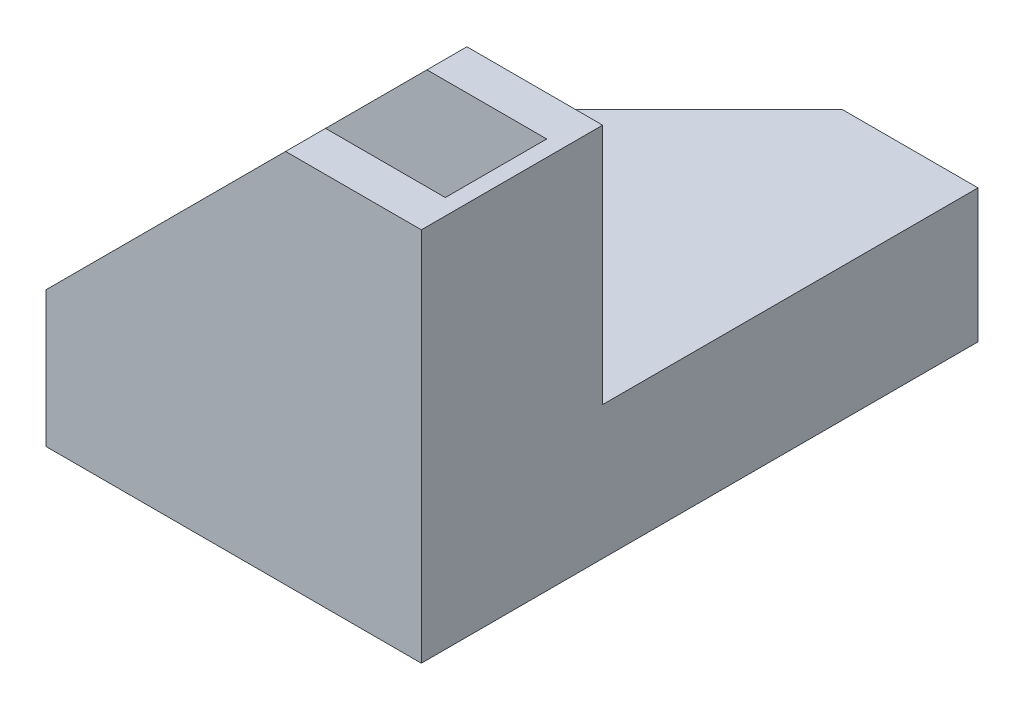
ISO-10303-21;
HEADER;
FILE_DESCRIPTION(('STEP AP214'),'2;1');
FILE_NAME('part.step','',(''),(''),'','','');
FILE_SCHEMA(('AUTOMOTIVE_DESIGN { 1 0 10303 214 1 1 1 1 }'));
ENDSEC;
DATA;
#1=APPLICATION_CONTEXT('core data for automotive mechanical design processes');
#2=APPLICATION_PROTOCOL_DEFINITION('international standard','automotive_design',2000,#1);
#3=PRODUCT_CONTEXT('',#1,'mechanical');
#4=PRODUCT('Part','Part','',(#3));
#5=PRODUCT_RELATED_PRODUCT_CATEGORY('part','',(#4));
#6=PRODUCT_DEFINITION_FORMATION('','',#4);
#7=PRODUCT_DEFINITION_CONTEXT('part definition',#1,'design');
#8=PRODUCT_DEFINITION('design','',#6,#7);
#9=PRODUCT_DEFINITION_SHAPE('','',#8);
#10=(LENGTH_UNIT() NAMED_UNIT(*) SI_UNIT(.MILLI.,.METRE.));
#11=(NAMED_UNIT(*) PLANE_ANGLE_UNIT() SI_UNIT($,.RADIAN.));
#12=(NAMED_UNIT(*) SI_UNIT($,.STERADIAN.) SOLID_ANGLE_UNIT());
#13=UNCERTAINTY_MEASURE_WITH_UNIT(LENGTH_MEASURE(1.E-05),#10,'distance_accuracy_value','');
#14=(GEOMETRIC_REPRESENTATION_CONTEXT(3) GLOBAL_UNCERTAINTY_ASSIGNED_CONTEXT((#13)) GLOBAL_UNIT_ASSIGNED_CONTEXT((#10,
#11,#12)) REPRESENTATION_CONTEXT('',''));
#15=CARTESIAN_POINT('',(0.,0.,0.));
#16=DIRECTION('',(0.,0.,1.));
#17=DIRECTION('',(1.,0.,0.));
#18=AXIS2_PLACEMENT_3D('',#15,#16,#17);
#19=CARTESIAN_POINT('',(0.,0.,-11.35));
#20=DIRECTION('',(0.,0.,-1.));
#21=DIRECTION('',(-1.,0.,0.));
#22=AXIS2_PLACEMENT_3D('',#19,#20,#21);
#23=PLANE('',#22);
#24=DIRECTION('',(1.,0.,0.));
#25=VECTOR('',#24,1.);
#26=CARTESIAN_POINT('',(-47.,16.7,-11.35));
#27=LINE('',#26,#25);
#28=CARTESIAN_POINT('',(-47.,16.7,-11.35));
#29=VERTEX_POINT('',#28);
#30=CARTESIAN_POINT('',(0.,16.7,-11.35));
#31=VERTEX_POINT('',#30);
#32=EDGE_CURVE('E287',#29,#31,#27,.T.);
#33=ORIENTED_EDGE('',*,*,#32,.F.);
#34=DIRECTION('',(0.,-1.,0.));
#35=VECTOR('',#34,1.);
#36=CARTESIAN_POINT('',(-47.,0.,-11.35));
#37=LINE('',#36,#35);
#38=CARTESIAN_POINT('',(-47.,17.,-11.35));
#39=VERTEX_POINT('',#38);
#40=EDGE_CURVE('E176',#39,#29,#37,.T.);
#41=ORIENTED_EDGE('',*,*,#40,.F.);
#42=DIRECTION('',(-0.707106781186547,-0.707106781186547,0.));
#43=VECTOR('',#42,1.);
#44=CARTESIAN_POINT('',(-17.,47.,-11.35));
#45=LINE('',#44,#43);
#46=CARTESIAN_POINT('',(-17.,47.,-11.35));
#47=VERTEX_POINT('',#46);
#48=EDGE_CURVE('E246',#47,#39,#45,.T.);
#49=ORIENTED_EDGE('',*,*,#48,.F.);
#50=DIRECTION('',(-1.,0.,0.));
#51=VECTOR('',#50,1.);
#52=CARTESIAN_POINT('',(0.,47.,-11.35));
#53=LINE('',#52,#51);
#54=CARTESIAN_POINT('',(0.,47.,-11.35));
#55=VERTEX_POINT('',#54);
#56=EDGE_CURVE('E243',#55,#47,#53,.T.);
#57=ORIENTED_EDGE('',*,*,#56,.F.);
#58=DIRECTION('',(0.,1.,0.));
#59=VECTOR('',#58,1.);
#60=CARTESIAN_POINT('',(0.,0.,-11.35));
#61=LINE('',#60,#59);
#62=EDGE_CURVE('E225',#31,#55,#61,.T.);
#63=ORIENTED_EDGE('',*,*,#62,.F.);
#64=EDGE_LOOP('',(#33,#41,#49,#57,#63));
#65=FACE_BOUND('',#64,.T.);
#66=ADVANCED_FACE('F33',(#65),#23,.T.);
#67=CARTESIAN_POINT('',(-17.,47.,11.35));
#68=DIRECTION('',(0.707106781186548,-0.707106781186548,0.));
#69=DIRECTION('',(0.707106781186548,0.707106781186548,0.));
#70=AXIS2_PLACEMENT_3D('',#67,#68,#69);
#71=PLANE('',#70);
#72=DIRECTION('',(-0.707106781186547,-0.707106781186547,0.));
#73=VECTOR('',#72,1.);
#74=CARTESIAN_POINT('',(-47.,17.,6.35));
#75=LINE('',#74,#73);
#76=CARTESIAN_POINT('',(-17.,47.,6.35));
#77=VERTEX_POINT('',#76);
#78=CARTESIAN_POINT('',(-47.,17.,6.35));
#79=VERTEX_POINT('',#78);
#80=EDGE_CURVE('E194',#77,#79,#75,.T.);
#81=ORIENTED_EDGE('',*,*,#80,.T.);
#82=DIRECTION('',(0.,0.,-1.));
#83=VECTOR('',#82,1.);
#84=CARTESIAN_POINT('',(-47.,17.,11.35));
#85=LINE('',#84,#83);
#86=CARTESIAN_POINT('',(-47.,17.,11.35));
#87=VERTEX_POINT('',#86);
#88=EDGE_CURVE('E254',#87,#79,#85,.T.);
#89=ORIENTED_EDGE('',*,*,#88,.F.);
#90=DIRECTION('',(-0.707106781186547,-0.707106781186547,0.));
#91=VECTOR('',#90,1.);
#92=CARTESIAN_POINT('',(-17.,47.,11.35));
#93=LINE('',#92,#91);
#94=CARTESIAN_POINT('',(-17.,47.,11.35));
#95=VERTEX_POINT('',#94);
#96=EDGE_CURVE('E237',#95,#87,#93,.T.);
#97=ORIENTED_EDGE('',*,*,#96,.F.);
#98=DIRECTION('',(0.,0.,-1.));
#99=VECTOR('',#98,1.);
#100=CARTESIAN_POINT('',(-17.,47.,11.35));
#101=LINE('',#100,#99);
#102=EDGE_CURVE('E258',#95,#77,#101,.T.);
#103=ORIENTED_EDGE('',*,*,#102,.T.);
#104=EDGE_LOOP('',(#81,#89,#97,#103));
#105=FACE_BOUND('',#104,.T.);
#106=ADVANCED_FACE('F334',(#105),#71,.F.);
#107=CARTESIAN_POINT('',(0.,0.,11.35));
#108=DIRECTION('',(0.,1.,0.));
#109=DIRECTION('',(-1.,0.,0.));
#110=AXIS2_PLACEMENT_3D('',#107,#108,#109);
#111=PLANE('',#110);
#112=DIRECTION('',(0.,0.,-1.));
#113=VECTOR('',#112,1.);
#114=CARTESIAN_POINT('',(-47.,0.,11.35));
#115=LINE('',#114,#113);
#116=CARTESIAN_POINT('',(-47.,0.,11.35));
#117=VERTEX_POINT('',#116);
#118=CARTESIAN_POINT('',(-47.,0.,-28.35));
#119=VERTEX_POINT('',#118);
#120=EDGE_CURVE('E241',#117,#119,#115,.T.);
#121=ORIENTED_EDGE('',*,*,#120,.T.);
#122=DIRECTION('',(0.707106781186548,0.,-0.707106781186548));
#123=VECTOR('',#122,1.);
#124=CARTESIAN_POINT('',(-43.35,0.,-32.));
#125=LINE('',#124,#123);
#126=CARTESIAN_POINT('',(-17.,0.,-58.35));
#127=VERTEX_POINT('',#126);
#128=EDGE_CURVE('E278',#119,#127,#125,.T.);
#129=ORIENTED_EDGE('',*,*,#128,.T.);
#130=DIRECTION('',(-1.,0.,0.));
#131=VECTOR('',#130,1.);
#132=CARTESIAN_POINT('',(-47.,0.,-58.35));
#133=LINE('',#132,#131);
#134=CARTESIAN_POINT('',(0.,0.,-58.35));
#135=VERTEX_POINT('',#134);
#136=EDGE_CURVE('E284',#135,#127,#133,.T.);
#137=ORIENTED_EDGE('',*,*,#136,.F.);
#138=DIRECTION('',(0.,0.,-1.));
#139=VECTOR('',#138,1.);
#140=CARTESIAN_POINT('',(0.,0.,11.35));
#141=LINE('',#140,#139);
#142=CARTESIAN_POINT('',(0.,0.,11.35));
#143=VERTEX_POINT('',#142);
#144=EDGE_CURVE('E263',#143,#135,#141,.T.);
#145=ORIENTED_EDGE('',*,*,#144,.F.);
#146=DIRECTION('',(1.,0.,0.));
#147=VECTOR('',#146,1.);
#148=CARTESIAN_POINT('',(0.,0.,11.35));
#149=LINE('',#148,#147);
#150=EDGE_CURVE('E230',#117,#143,#149,.T.);
#151=ORIENTED_EDGE('',*,*,#150,.F.);
#152=EDGE_LOOP('',(#121,#129,#137,#145,#151));
#153=FACE_BOUND('',#152,.T.);
#154=ADVANCED_FACE('F35',(#153),#111,.F.);
#155=CARTESIAN_POINT('',(0.,0.,11.35));
#156=DIRECTION('',(-1.,0.,0.));
#157=DIRECTION('',(0.,0.,1.));
#158=AXIS2_PLACEMENT_3D('',#155,#156,#157);
#159=PLANE('',#158);
#160=ORIENTED_EDGE('',*,*,#144,.T.);
#161=DIRECTION('',(0.,-1.,0.));
#162=VECTOR('',#161,1.);
#163=CARTESIAN_POINT('',(0.,14.7,-58.35));
#164=LINE('',#163,#162);
#165=CARTESIAN_POINT('',(0.,16.7,-58.35));
#166=VERTEX_POINT('',#165);
#167=EDGE_CURVE('E183',#166,#135,#164,.T.);
#168=ORIENTED_EDGE('',*,*,#167,.F.);
#169=DIRECTION('',(0.,0.,1.));
#170=VECTOR('',#169,1.);
#171=CARTESIAN_POINT('',(0.,16.7,-58.35));
#172=LINE('',#171,#170);
#173=EDGE_CURVE('E178',#166,#31,#172,.T.);
#174=ORIENTED_EDGE('',*,*,#173,.T.);
#175=ORIENTED_EDGE('',*,*,#62,.T.);
#176=DIRECTION('',(0.,0.,-1.));
#177=VECTOR('',#176,1.);
#178=CARTESIAN_POINT('',(0.,47.,11.35));
#179=LINE('',#178,#177);
#180=CARTESIAN_POINT('',(0.,47.,11.35));
#181=VERTEX_POINT('',#180);
#182=EDGE_CURVE('E261',#181,#55,#179,.T.);
#183=ORIENTED_EDGE('',*,*,#182,.F.);
#184=DIRECTION('',(0.,1.,0.));
#185=VECTOR('',#184,1.);
#186=CARTESIAN_POINT('',(0.,0.,11.35));
#187=LINE('',#186,#185);
#188=EDGE_CURVE('E233',#143,#181,#187,.T.);
#189=ORIENTED_EDGE('',*,*,#188,.F.);
#190=EDGE_LOOP('',(#160,#168,#174,#175,#183,#189));
#191=FACE_BOUND('',#190,.T.);
#192=ADVANCED_FACE('F301',(#191),#159,.F.);
#193=CARTESIAN_POINT('',(0.,47.,11.35));
#194=DIRECTION('',(0.,-1.,0.));
#195=DIRECTION('',(0.,0.,-1.));
#196=AXIS2_PLACEMENT_3D('',#193,#194,#195);
#197=PLANE('',#196);
#198=CARTESIAN_POINT('',(-17.,47.,-6.35));
#199=VERTEX_POINT('',#198);
#200=EDGE_CURVE('E257',#199,#47,#101,.T.);
#201=ORIENTED_EDGE('',*,*,#200,.F.);
#202=DIRECTION('',(-1.,0.,0.));
#203=VECTOR('',#202,1.);
#204=CARTESIAN_POINT('',(-17.,47.,-6.35));
#205=LINE('',#204,#203);
#206=CARTESIAN_POINT('',(-2.,47.,-6.35));
#207=VERTEX_POINT('',#206);
#208=EDGE_CURVE('E207',#207,#199,#205,.T.);
#209=ORIENTED_EDGE('',*,*,#208,.F.);
#210=DIRECTION('',(0.,0.,1.));
#211=VECTOR('',#210,1.);
#212=CARTESIAN_POINT('',(-2.,47.,-6.35));
#213=LINE('',#212,#211);
#214=CARTESIAN_POINT('',(-2.,47.,6.35));
#215=VERTEX_POINT('',#214);
#216=EDGE_CURVE('E222',#207,#215,#213,.T.);
#217=ORIENTED_EDGE('',*,*,#216,.T.);
#218=DIRECTION('',(-1.,0.,0.));
#219=VECTOR('',#218,1.);
#220=CARTESIAN_POINT('',(-17.,47.,6.35));
#221=LINE('',#220,#219);
#222=EDGE_CURVE('E198',#215,#77,#221,.T.);
#223=ORIENTED_EDGE('',*,*,#222,.T.);
#224=ORIENTED_EDGE('',*,*,#102,.F.);
#225=DIRECTION('',(-1.,0.,0.));
#226=VECTOR('',#225,1.);
#227=CARTESIAN_POINT('',(0.,47.,11.35));
#228=LINE('',#227,#226);
#229=EDGE_CURVE('E235',#181,#95,#228,.T.);
#230=ORIENTED_EDGE('',*,*,#229,.F.);
#231=ORIENTED_EDGE('',*,*,#182,.T.);
#232=ORIENTED_EDGE('',*,*,#56,.T.);
#233=EDGE_LOOP('',(#201,#209,#217,#223,#224,#230,#231,#232));
#234=FACE_BOUND('',#233,.T.);
#235=ADVANCED_FACE('F383',(#234),#197,.F.);
#236=CARTESIAN_POINT('',(-47.,17.,-6.35));
#237=VERTEX_POINT('',#236);
#238=EDGE_CURVE('E253',#237,#39,#85,.T.);
#239=ORIENTED_EDGE('',*,*,#238,.F.);
#240=DIRECTION('',(-0.707106781186547,-0.707106781186547,0.));
#241=VECTOR('',#240,1.);
#242=CARTESIAN_POINT('',(-47.,17.,-6.35));
#243=LINE('',#242,#241);
#244=EDGE_CURVE('E195',#199,#237,#243,.T.);
#245=ORIENTED_EDGE('',*,*,#244,.F.);
#246=ORIENTED_EDGE('',*,*,#200,.T.);
#247=ORIENTED_EDGE('',*,*,#48,.T.);
#248=EDGE_LOOP('',(#239,#245,#246,#247));
#249=FACE_BOUND('',#248,.T.);
#250=ADVANCED_FACE('F343',(#249),#71,.F.);
#251=CARTESIAN_POINT('',(-47.,0.,11.35));
#252=DIRECTION('',(1.,0.,0.));
#253=DIRECTION('',(0.,0.,-1.));
#254=AXIS2_PLACEMENT_3D('',#251,#252,#253);
#255=PLANE('',#254);
#256=DIRECTION('',(0.,0.,1.));
#257=VECTOR('',#256,1.);
#258=CARTESIAN_POINT('',(-47.,16.7,-58.35));
#259=LINE('',#258,#257);
#260=CARTESIAN_POINT('',(-47.,16.7,-28.35));
#261=VERTEX_POINT('',#260);
#262=EDGE_CURVE('E168',#261,#29,#259,.T.);
#263=ORIENTED_EDGE('',*,*,#262,.F.);
#264=DIRECTION('',(0.,1.,0.));
#265=VECTOR('',#264,1.);
#266=CARTESIAN_POINT('',(-47.,-30.3,-28.35));
#267=LINE('',#266,#265);
#268=CARTESIAN_POINT('',(-47.,14.7,-28.35));
#269=VERTEX_POINT('',#268);
#270=EDGE_CURVE('E155',#269,#261,#267,.T.);
#271=ORIENTED_EDGE('',*,*,#270,.F.);
#272=DIRECTION('',(0.,0.,1.));
#273=VECTOR('',#272,1.);
#274=CARTESIAN_POINT('',(-47.,14.7,-58.35));
#275=LINE('',#274,#273);
#276=CARTESIAN_POINT('',(-47.,14.7,-11.35));
#277=VERTEX_POINT('',#276);
#278=EDGE_CURVE('E177',#269,#277,#275,.T.);
#279=ORIENTED_EDGE('',*,*,#278,.T.);
#280=CARTESIAN_POINT('',(-47.,2.,-11.35));
#281=VERTEX_POINT('',#280);
#282=EDGE_CURVE('E249',#277,#281,#37,.T.);
#283=ORIENTED_EDGE('',*,*,#282,.T.);
#284=DIRECTION('',(0.,0.,1.));
#285=VECTOR('',#284,1.);
#286=CARTESIAN_POINT('',(-47.,2.,-58.35));
#287=LINE('',#286,#285);
#288=CARTESIAN_POINT('',(-47.,2.,-28.35));
#289=VERTEX_POINT('',#288);
#290=EDGE_CURVE('E192',#289,#281,#287,.T.);
#291=ORIENTED_EDGE('',*,*,#290,.F.);
#292=EDGE_CURVE('E162',#119,#289,#267,.T.);
#293=ORIENTED_EDGE('',*,*,#292,.F.);
#294=ORIENTED_EDGE('',*,*,#120,.F.);
#295=DIRECTION('',(0.,-1.,0.));
#296=VECTOR('',#295,1.);
#297=CARTESIAN_POINT('',(-47.,0.,11.35));
#298=LINE('',#297,#296);
#299=EDGE_CURVE('E239',#87,#117,#298,.T.);
#300=ORIENTED_EDGE('',*,*,#299,.F.);
#301=ORIENTED_EDGE('',*,*,#88,.T.);
#302=DIRECTION('',(0.,-1.,0.));
#303=VECTOR('',#302,1.);
#304=CARTESIAN_POINT('',(-47.,17.,6.35));
#305=LINE('',#304,#303);
#306=CARTESIAN_POINT('',(-47.,1.99999999999999,6.35));
#307=VERTEX_POINT('',#306);
#308=EDGE_CURVE('E212',#79,#307,#305,.T.);
#309=ORIENTED_EDGE('',*,*,#308,.T.);
#310=DIRECTION('',(0.,0.,1.));
#311=VECTOR('',#310,1.);
#312=CARTESIAN_POINT('',(-47.,1.99999999999999,-6.35));
#313=LINE('',#312,#311);
#314=CARTESIAN_POINT('',(-47.,1.99999999999999,-6.35));
#315=VERTEX_POINT('',#314);
#316=EDGE_CURVE('E209',#315,#307,#313,.T.);
#317=ORIENTED_EDGE('',*,*,#316,.F.);
#318=DIRECTION('',(0.,-1.,0.));
#319=VECTOR('',#318,1.);
#320=CARTESIAN_POINT('',(-47.,17.,-6.35));
#321=LINE('',#320,#319);
#322=EDGE_CURVE('E197',#237,#315,#321,.T.);
#323=ORIENTED_EDGE('',*,*,#322,.F.);
#324=ORIENTED_EDGE('',*,*,#238,.T.);
#325=ORIENTED_EDGE('',*,*,#40,.T.);
#326=EDGE_LOOP('',(#263,#271,#279,#283,#291,#293,#294,#300,#301,#309,#317,#323,#324,#325));
#327=FACE_BOUND('',#326,.T.);
#328=ADVANCED_FACE('F174',(#327),#255,.F.);
#329=CARTESIAN_POINT('',(0.,0.,11.35));
#330=DIRECTION('',(0.,0.,-1.));
#331=DIRECTION('',(-1.,0.,0.));
#332=AXIS2_PLACEMENT_3D('',#329,#330,#331);
#333=PLANE('',#332);
#334=ORIENTED_EDGE('',*,*,#150,.T.);
#335=ORIENTED_EDGE('',*,*,#188,.T.);
#336=ORIENTED_EDGE('',*,*,#229,.T.);
#337=ORIENTED_EDGE('',*,*,#96,.T.);
#338=ORIENTED_EDGE('',*,*,#299,.T.);
#339=EDGE_LOOP('',(#334,#335,#336,#337,#338));
#340=FACE_BOUND('',#339,.T.);
#341=ADVANCED_FACE('F348',(#340),#333,.F.);
#342=DIRECTION('',(-1.,0.,0.));
#343=VECTOR('',#342,1.);
#344=CARTESIAN_POINT('',(-47.,14.7,-11.35));
#345=LINE('',#344,#343);
#346=CARTESIAN_POINT('',(-2.,14.7,-11.35));
#347=VERTEX_POINT('',#346);
#348=EDGE_CURVE('E299',#347,#277,#345,.T.);
#349=ORIENTED_EDGE('',*,*,#348,.F.);
#350=DIRECTION('',(0.,1.,0.));
#351=VECTOR('',#350,1.);
#352=CARTESIAN_POINT('',(-2.,14.7,-11.35));
#353=LINE('',#352,#351);
#354=CARTESIAN_POINT('',(-2.,2.,-11.35));
#355=VERTEX_POINT('',#354);
#356=EDGE_CURVE('E296',#355,#347,#353,.T.);
#357=ORIENTED_EDGE('',*,*,#356,.F.);
#358=DIRECTION('',(1.,0.,0.));
#359=VECTOR('',#358,1.);
#360=CARTESIAN_POINT('',(-2.,2.,-11.35));
#361=LINE('',#360,#359);
#362=EDGE_CURVE('E283',#281,#355,#361,.T.);
#363=ORIENTED_EDGE('',*,*,#362,.F.);
#364=ORIENTED_EDGE('',*,*,#282,.F.);
#365=EDGE_LOOP('',(#349,#357,#363,#364));
#366=FACE_BOUND('',#365,.T.);
#367=ADVANCED_FACE('F319',(#366),#23,.T.);
#368=CARTESIAN_POINT('',(-2.,47.,-6.35));
#369=DIRECTION('',(1.,0.,0.));
#370=DIRECTION('',(0.,0.,-1.));
#371=AXIS2_PLACEMENT_3D('',#368,#369,#370);
#372=PLANE('',#371);
#373=DIRECTION('',(0.,1.,0.));
#374=VECTOR('',#373,1.);
#375=CARTESIAN_POINT('',(-2.,47.,6.35));
#376=LINE('',#375,#374);
#377=CARTESIAN_POINT('',(-2.,1.99999999999999,6.35));
#378=VERTEX_POINT('',#377);
#379=EDGE_CURVE('E218',#378,#215,#376,.T.);
#380=ORIENTED_EDGE('',*,*,#379,.T.);
#381=ORIENTED_EDGE('',*,*,#216,.F.);
#382=DIRECTION('',(0.,1.,0.));
#383=VECTOR('',#382,1.);
#384=CARTESIAN_POINT('',(-2.,47.,-6.35));
#385=LINE('',#384,#383);
#386=CARTESIAN_POINT('',(-2.,1.99999999999999,-6.35));
#387=VERTEX_POINT('',#386);
#388=EDGE_CURVE('E204',#387,#207,#385,.T.);
#389=ORIENTED_EDGE('',*,*,#388,.F.);
#390=DIRECTION('',(0.,0.,1.));
#391=VECTOR('',#390,1.);
#392=CARTESIAN_POINT('',(-2.,1.99999999999999,-6.35));
#393=LINE('',#392,#391);
#394=EDGE_CURVE('E226',#387,#378,#393,.T.);
#395=ORIENTED_EDGE('',*,*,#394,.T.);
#396=EDGE_LOOP('',(#380,#381,#389,#395));
#397=FACE_BOUND('',#396,.T.);
#398=ADVANCED_FACE('F347',(#397),#372,.F.);
#399=CARTESIAN_POINT('',(-2.,1.99999999999999,-6.35));
#400=DIRECTION('',(0.,-1.,0.));
#401=DIRECTION('',(0.,0.,-1.));
#402=AXIS2_PLACEMENT_3D('',#399,#400,#401);
#403=PLANE('',#402);
#404=DIRECTION('',(1.,0.,0.));
#405=VECTOR('',#404,1.);
#406=CARTESIAN_POINT('',(-2.,1.99999999999999,6.35));
#407=LINE('',#406,#405);
#408=EDGE_CURVE('E215',#307,#378,#407,.T.);
#409=ORIENTED_EDGE('',*,*,#408,.T.);
#410=ORIENTED_EDGE('',*,*,#394,.F.);
#411=DIRECTION('',(1.,0.,0.));
#412=VECTOR('',#411,1.);
#413=CARTESIAN_POINT('',(-2.,1.99999999999999,-6.35));
#414=LINE('',#413,#412);
#415=EDGE_CURVE('E201',#315,#387,#414,.T.);
#416=ORIENTED_EDGE('',*,*,#415,.F.);
#417=ORIENTED_EDGE('',*,*,#316,.T.);
#418=EDGE_LOOP('',(#409,#410,#416,#417));
#419=FACE_BOUND('',#418,.T.);
#420=ADVANCED_FACE('F352',(#419),#403,.F.);
#421=CARTESIAN_POINT('',(0.,0.,-6.35));
#422=DIRECTION('',(0.,0.,-1.));
#423=DIRECTION('',(-1.,0.,0.));
#424=AXIS2_PLACEMENT_3D('',#421,#422,#423);
#425=PLANE('',#424);
#426=ORIENTED_EDGE('',*,*,#244,.T.);
#427=ORIENTED_EDGE('',*,*,#322,.T.);
#428=ORIENTED_EDGE('',*,*,#415,.T.);
#429=ORIENTED_EDGE('',*,*,#388,.T.);
#430=ORIENTED_EDGE('',*,*,#208,.T.);
#431=EDGE_LOOP('',(#426,#427,#428,#429,#430));
#432=FACE_BOUND('',#431,.T.);
#433=ADVANCED_FACE('F363',(#432),#425,.F.);
#434=CARTESIAN_POINT('',(0.,0.,6.35));
#435=DIRECTION('',(0.,0.,-1.));
#436=DIRECTION('',(-1.,0.,0.));
#437=AXIS2_PLACEMENT_3D('',#434,#435,#436);
#438=PLANE('',#437);
#439=ORIENTED_EDGE('',*,*,#80,.F.);
#440=ORIENTED_EDGE('',*,*,#222,.F.);
#441=ORIENTED_EDGE('',*,*,#379,.F.);
#442=ORIENTED_EDGE('',*,*,#408,.F.);
#443=ORIENTED_EDGE('',*,*,#308,.F.);
#444=EDGE_LOOP('',(#439,#440,#441,#442,#443));
#445=FACE_BOUND('',#444,.T.);
#446=ADVANCED_FACE('F331',(#445),#438,.T.);
#447=CARTESIAN_POINT('',(-2.,2.,-58.35));
#448=DIRECTION('',(0.,-1.,0.));
#449=DIRECTION('',(0.,0.,-1.));
#450=AXIS2_PLACEMENT_3D('',#447,#448,#449);
#451=PLANE('',#450);
#452=DIRECTION('',(1.,0.,0.));
#453=VECTOR('',#452,1.);
#454=CARTESIAN_POINT('',(-2.,2.,-58.35));
#455=LINE('',#454,#453);
#456=CARTESIAN_POINT('',(-17.,2.,-58.35));
#457=VERTEX_POINT('',#456);
#458=CARTESIAN_POINT('',(-2.,2.,-58.35));
#459=VERTEX_POINT('',#458);
#460=EDGE_CURVE('E286',#457,#459,#455,.T.);
#461=ORIENTED_EDGE('',*,*,#460,.F.);
#462=DIRECTION('',(-0.707106781186548,0.,0.707106781186548));
#463=VECTOR('',#462,1.);
#464=CARTESIAN_POINT('',(-9.5,2.,-65.85));
#465=LINE('',#464,#463);
#466=EDGE_CURVE('E56',#457,#289,#465,.T.);
#467=ORIENTED_EDGE('',*,*,#466,.T.);
#468=ORIENTED_EDGE('',*,*,#290,.T.);
#469=ORIENTED_EDGE('',*,*,#362,.T.);
#470=DIRECTION('',(0.,0.,1.));
#471=VECTOR('',#470,1.);
#472=CARTESIAN_POINT('',(-2.,2.,-58.35));
#473=LINE('',#472,#471);
#474=EDGE_CURVE('E189',#459,#355,#473,.T.);
#475=ORIENTED_EDGE('',*,*,#474,.F.);
#476=EDGE_LOOP('',(#461,#467,#468,#469,#475));
#477=FACE_BOUND('',#476,.T.);
#478=ADVANCED_FACE('F316',(#477),#451,.F.);
#479=CARTESIAN_POINT('',(-2.,14.7,-58.35));
#480=DIRECTION('',(1.,0.,0.));
#481=DIRECTION('',(0.,0.,-1.));
#482=AXIS2_PLACEMENT_3D('',#479,#480,#481);
#483=PLANE('',#482);
#484=ORIENTED_EDGE('',*,*,#356,.T.);
#485=DIRECTION('',(0.,0.,1.));
#486=VECTOR('',#485,1.);
#487=CARTESIAN_POINT('',(-2.,14.7,-58.35));
#488=LINE('',#487,#486);
#489=CARTESIAN_POINT('',(-2.,14.7,-58.35));
#490=VERTEX_POINT('',#489);
#491=EDGE_CURVE('E180',#490,#347,#488,.T.);
#492=ORIENTED_EDGE('',*,*,#491,.F.);
#493=DIRECTION('',(0.,1.,0.));
#494=VECTOR('',#493,1.);
#495=CARTESIAN_POINT('',(-2.,14.7,-58.35));
#496=LINE('',#495,#494);
#497=EDGE_CURVE('E289',#459,#490,#496,.T.);
#498=ORIENTED_EDGE('',*,*,#497,.F.);
#499=ORIENTED_EDGE('',*,*,#474,.T.);
#500=EDGE_LOOP('',(#484,#492,#498,#499));
#501=FACE_BOUND('',#500,.T.);
#502=ADVANCED_FACE('F322',(#501),#483,.F.);
#503=CARTESIAN_POINT('',(-47.,14.7,-58.35));
#504=DIRECTION('',(0.,1.,0.));
#505=DIRECTION('',(0.,0.,1.));
#506=AXIS2_PLACEMENT_3D('',#503,#504,#505);
#507=PLANE('',#506);
#508=ORIENTED_EDGE('',*,*,#278,.F.);
#509=DIRECTION('',(0.707106781186548,0.,-0.707106781186548));
#510=VECTOR('',#509,1.);
#511=CARTESIAN_POINT('',(-32.,14.7,-43.35));
#512=LINE('',#511,#510);
#513=CARTESIAN_POINT('',(-17.,14.7,-58.35));
#514=VERTEX_POINT('',#513);
#515=EDGE_CURVE('E158',#269,#514,#512,.T.);
#516=ORIENTED_EDGE('',*,*,#515,.T.);
#517=DIRECTION('',(-1.,0.,0.));
#518=VECTOR('',#517,1.);
#519=CARTESIAN_POINT('',(-47.,14.7,-58.35));
#520=LINE('',#519,#518);
#521=EDGE_CURVE('E273',#490,#514,#520,.T.);
#522=ORIENTED_EDGE('',*,*,#521,.F.);
#523=ORIENTED_EDGE('',*,*,#491,.T.);
#524=ORIENTED_EDGE('',*,*,#348,.T.);
#525=EDGE_LOOP('',(#508,#516,#522,#523,#524));
#526=FACE_BOUND('',#525,.T.);
#527=ADVANCED_FACE('F275',(#526),#507,.F.);
#528=CARTESIAN_POINT('',(-47.,16.7,-58.35));
#529=DIRECTION('',(0.,-1.,0.));
#530=DIRECTION('',(0.,0.,-1.));
#531=AXIS2_PLACEMENT_3D('',#528,#529,#530);
#532=PLANE('',#531);
#533=DIRECTION('',(1.,0.,0.));
#534=VECTOR('',#533,1.);
#535=CARTESIAN_POINT('',(-47.,16.7,-58.35));
#536=LINE('',#535,#534);
#537=CARTESIAN_POINT('',(-17.,16.7,-58.35));
#538=VERTEX_POINT('',#537);
#539=EDGE_CURVE('E171',#538,#166,#536,.T.);
#540=ORIENTED_EDGE('',*,*,#539,.F.);
#541=DIRECTION('',(0.707106781186547,0.,-0.707106781186547));
#542=VECTOR('',#541,1.);
#543=CARTESIAN_POINT('',(-17.,16.7,-58.35));
#544=LINE('',#543,#542);
#545=EDGE_CURVE('E48',#261,#538,#544,.T.);
#546=ORIENTED_EDGE('',*,*,#545,.F.);
#547=ORIENTED_EDGE('',*,*,#262,.T.);
#548=ORIENTED_EDGE('',*,*,#32,.T.);
#549=ORIENTED_EDGE('',*,*,#173,.F.);
#550=EDGE_LOOP('',(#540,#546,#547,#548,#549));
#551=FACE_BOUND('',#550,.T.);
#552=ADVANCED_FACE('F166',(#551),#532,.F.);
#553=CARTESIAN_POINT('',(0.,0.,-58.35));
#554=DIRECTION('',(0.,0.,1.));
#555=DIRECTION('',(1.,0.,0.));
#556=AXIS2_PLACEMENT_3D('',#553,#554,#555);
#557=PLANE('',#556);
#558=ORIENTED_EDGE('',*,*,#136,.T.);
#559=DIRECTION('',(0.,1.,0.));
#560=VECTOR('',#559,1.);
#561=CARTESIAN_POINT('',(-17.,0.,-58.35));
#562=LINE('',#561,#560);
#563=EDGE_CURVE('E11',#127,#457,#562,.T.);
#564=ORIENTED_EDGE('',*,*,#563,.T.);
#565=ORIENTED_EDGE('',*,*,#460,.T.);
#566=ORIENTED_EDGE('',*,*,#497,.T.);
#567=ORIENTED_EDGE('',*,*,#521,.T.);
#568=EDGE_CURVE('E37',#514,#538,#562,.T.);
#569=ORIENTED_EDGE('',*,*,#568,.T.);
#570=ORIENTED_EDGE('',*,*,#539,.T.);
#571=ORIENTED_EDGE('',*,*,#167,.T.);
#572=EDGE_LOOP('',(#558,#564,#565,#566,#567,#569,#570,#571));
#573=FACE_BOUND('',#572,.T.);
#574=ADVANCED_FACE('F271',(#573),#557,.F.);
#575=CARTESIAN_POINT('',(-17.,-30.3,-58.35));
#576=DIRECTION('',(0.707106781186547,0.,0.707106781186547));
#577=DIRECTION('',(0.707106781186548,0.,-0.707106781186548));
#578=AXIS2_PLACEMENT_3D('',#575,#576,#577);
#579=PLANE('',#578);
#580=ORIENTED_EDGE('',*,*,#270,.T.);
#581=ORIENTED_EDGE('',*,*,#545,.T.);
#582=ORIENTED_EDGE('',*,*,#568,.F.);
#583=ORIENTED_EDGE('',*,*,#515,.F.);
#584=EDGE_LOOP('',(#580,#581,#582,#583));
#585=FACE_BOUND('',#584,.T.);
#586=ADVANCED_FACE('F156',(#585),#579,.F.);
#587=ORIENTED_EDGE('',*,*,#292,.T.);
#588=ORIENTED_EDGE('',*,*,#466,.F.);
#589=ORIENTED_EDGE('',*,*,#563,.F.);
#590=ORIENTED_EDGE('',*,*,#128,.F.);
#591=EDGE_LOOP('',(#587,#588,#589,#590));
#592=FACE_BOUND('',#591,.T.);
#593=ADVANCED_FACE('F308',(#592),#579,.F.);
#594=CLOSED_SHELL('',(#66,#106,#154,#192,#235,#250,#328,#341,#367,#398,#420,#433,#446,#478,#502,
#527,#552,#574,#586,#593));
#595=MANIFOLD_SOLID_BREP('B2',#594);
#596=ADVANCED_BREP_SHAPE_REPRESENTATION('',(#18,#595),#14);
#597=SHAPE_DEFINITION_REPRESENTATION(#9,#596);
ENDSEC;
END-ISO-10303-21;
